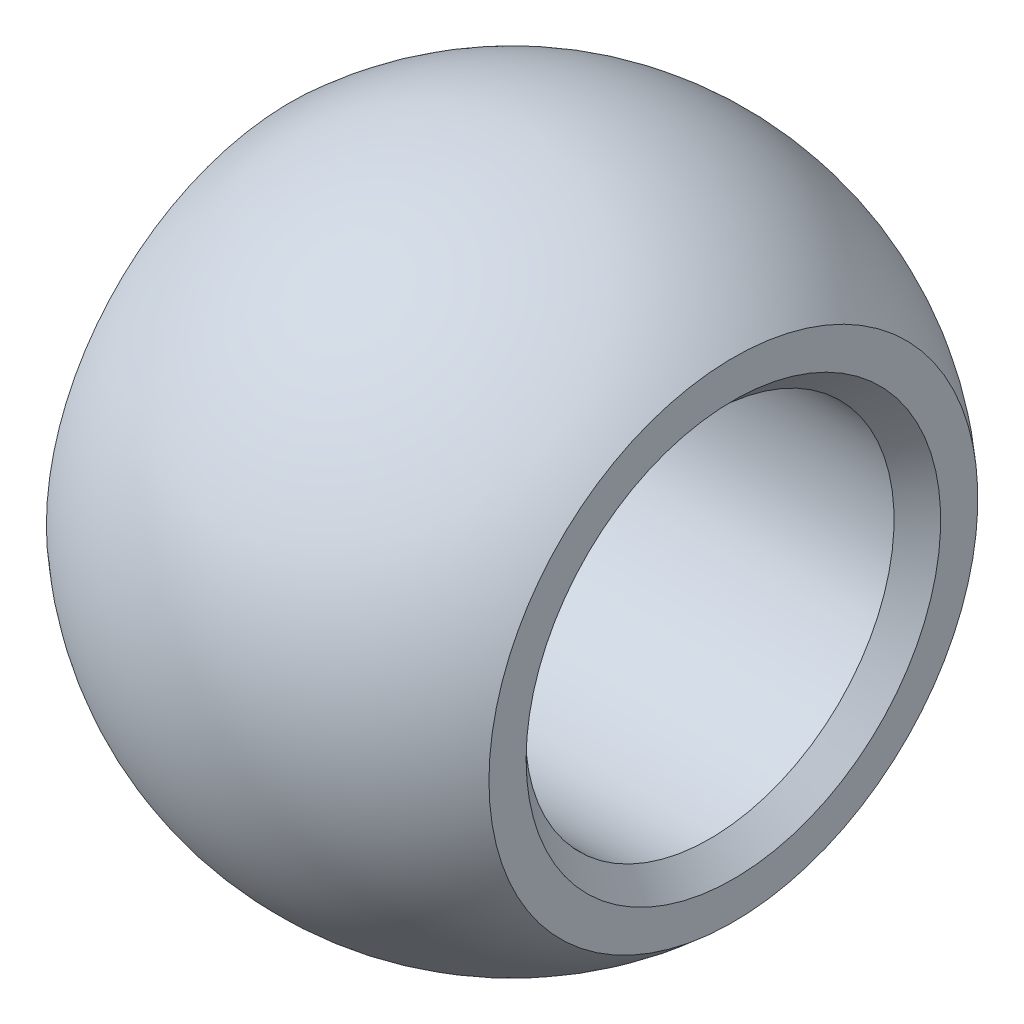
ISO-10303-21;
HEADER;
FILE_DESCRIPTION(('STEP AP214'),'2;1');
FILE_NAME('part.step','',(''),(''),'','','');
FILE_SCHEMA(('AUTOMOTIVE_DESIGN { 1 0 10303 214 1 1 1 1 }'));
ENDSEC;
DATA;
#1=APPLICATION_CONTEXT('core data for automotive mechanical design processes');
#2=APPLICATION_PROTOCOL_DEFINITION('international standard','automotive_design',2000,#1);
#3=PRODUCT_CONTEXT('',#1,'mechanical');
#4=PRODUCT('Part','Part','',(#3));
#5=PRODUCT_RELATED_PRODUCT_CATEGORY('part','',(#4));
#6=PRODUCT_DEFINITION_FORMATION('','',#4);
#7=PRODUCT_DEFINITION_CONTEXT('part definition',#1,'design');
#8=PRODUCT_DEFINITION('design','',#6,#7);
#9=PRODUCT_DEFINITION_SHAPE('','',#8);
#10=(LENGTH_UNIT() NAMED_UNIT(*) SI_UNIT(.MILLI.,.METRE.));
#11=(NAMED_UNIT(*) PLANE_ANGLE_UNIT() SI_UNIT($,.RADIAN.));
#12=(NAMED_UNIT(*) SI_UNIT($,.STERADIAN.) SOLID_ANGLE_UNIT());
#13=UNCERTAINTY_MEASURE_WITH_UNIT(LENGTH_MEASURE(1.E-05),#10,'distance_accuracy_value','');
#14=(GEOMETRIC_REPRESENTATION_CONTEXT(3) GLOBAL_UNCERTAINTY_ASSIGNED_CONTEXT((#13)) GLOBAL_UNIT_ASSIGNED_CONTEXT((#10,
#11,#12)) REPRESENTATION_CONTEXT('',''));
#15=CARTESIAN_POINT('',(0.,0.,0.));
#16=DIRECTION('',(0.,0.,1.));
#17=DIRECTION('',(1.,0.,0.));
#18=AXIS2_PLACEMENT_3D('',#15,#16,#17);
#19=CARTESIAN_POINT('',(0.,0.,0.));
#20=DIRECTION('',(-1.,0.,0.));
#21=DIRECTION('',(0.,1.,0.));
#22=AXIS2_PLACEMENT_3D('',#19,#20,#21);
#23=SPHERICAL_SURFACE('',#22,7.1);
#24=CARTESIAN_POINT('',(-4.765,0.,0.));
#25=DIRECTION('',(-1.,0.,0.));
#26=DIRECTION('',(0.,0.,1.));
#27=AXIS2_PLACEMENT_3D('',#24,#25,#26);
#28=CIRCLE('',#27,5.26353255903296);
#29=CARTESIAN_POINT('',(-4.765,0.,5.26353255903296));
#30=VERTEX_POINT('',#29);
#31=EDGE_CURVE('E53',#30,#30,#28,.T.);
#32=ORIENTED_EDGE('',*,*,#31,.F.);
#33=EDGE_LOOP('',(#32));
#34=FACE_BOUND('',#33,.T.);
#35=CARTESIAN_POINT('',(4.765,0.,0.));
#36=DIRECTION('',(-1.,0.,0.));
#37=DIRECTION('',(0.,0.,1.));
#38=AXIS2_PLACEMENT_3D('',#35,#36,#37);
#39=CIRCLE('',#38,5.26353255903296);
#40=CARTESIAN_POINT('',(4.765,0.,5.26353255903296));
#41=VERTEX_POINT('',#40);
#42=EDGE_CURVE('E10',#41,#41,#39,.T.);
#43=ORIENTED_EDGE('',*,*,#42,.T.);
#44=EDGE_LOOP('',(#43));
#45=FACE_BOUND('',#44,.T.);
#46=ADVANCED_FACE('F31',(#34,#45),#23,.T.);
#47=CARTESIAN_POINT('',(4.765,4.46353255903296,0.));
#48=DIRECTION('',(-1.,0.,0.));
#49=DIRECTION('',(0.,0.,1.));
#50=AXIS2_PLACEMENT_3D('',#47,#48,#49);
#51=PLANE('',#50);
#52=ORIENTED_EDGE('',*,*,#42,.F.);
#53=EDGE_LOOP('',(#52));
#54=FACE_BOUND('',#53,.T.);
#55=CARTESIAN_POINT('',(4.765,0.,0.));
#56=DIRECTION('',(-1.,0.,0.));
#57=DIRECTION('',(0.,0.,1.));
#58=AXIS2_PLACEMENT_3D('',#55,#56,#57);
#59=CIRCLE('',#58,4.46353255903296);
#60=CARTESIAN_POINT('',(4.765,0.,4.46353255903296));
#61=VERTEX_POINT('',#60);
#62=EDGE_CURVE('E37',#61,#61,#59,.T.);
#63=ORIENTED_EDGE('',*,*,#62,.T.);
#64=EDGE_LOOP('',(#63));
#65=FACE_BOUND('',#64,.T.);
#66=ADVANCED_FACE('F60',(#54,#65),#51,.F.);
#67=CARTESIAN_POINT('',(4.255,0.,0.));
#68=DIRECTION('',(1.,0.,0.));
#69=DIRECTION('',(0.,0.,-1.));
#70=AXIS2_PLACEMENT_3D('',#67,#68,#69);
#71=CONICAL_SURFACE('',#70,3.97,0.768990162490585);
#72=ORIENTED_EDGE('',*,*,#62,.F.);
#73=EDGE_LOOP('',(#72));
#74=FACE_BOUND('',#73,.T.);
#75=CARTESIAN_POINT('',(4.255,0.,0.));
#76=DIRECTION('',(-1.,0.,0.));
#77=DIRECTION('',(0.,0.,1.));
#78=AXIS2_PLACEMENT_3D('',#75,#76,#77);
#79=CIRCLE('',#78,3.97);
#80=CARTESIAN_POINT('',(4.255,0.,3.97));
#81=VERTEX_POINT('',#80);
#82=EDGE_CURVE('E41',#81,#81,#79,.T.);
#83=ORIENTED_EDGE('',*,*,#82,.T.);
#84=EDGE_LOOP('',(#83));
#85=FACE_BOUND('',#84,.T.);
#86=ADVANCED_FACE('F64',(#74,#85),#71,.F.);
#87=CARTESIAN_POINT('',(-4.765,0.,0.));
#88=DIRECTION('',(-1.,0.,0.));
#89=DIRECTION('',(0.,0.,1.));
#90=AXIS2_PLACEMENT_3D('',#87,#88,#89);
#91=CYLINDRICAL_SURFACE('',#90,3.97);
#92=ORIENTED_EDGE('',*,*,#82,.F.);
#93=EDGE_LOOP('',(#92));
#94=FACE_BOUND('',#93,.T.);
#95=CARTESIAN_POINT('',(-4.255,0.,0.));
#96=DIRECTION('',(-1.,0.,0.));
#97=DIRECTION('',(0.,0.,1.));
#98=AXIS2_PLACEMENT_3D('',#95,#96,#97);
#99=CIRCLE('',#98,3.97);
#100=CARTESIAN_POINT('',(-4.255,0.,3.97));
#101=VERTEX_POINT('',#100);
#102=EDGE_CURVE('E45',#101,#101,#99,.T.);
#103=ORIENTED_EDGE('',*,*,#102,.T.);
#104=EDGE_LOOP('',(#103));
#105=FACE_BOUND('',#104,.T.);
#106=ADVANCED_FACE('F69',(#94,#105),#91,.F.);
#107=CARTESIAN_POINT('',(-4.765,0.,0.));
#108=DIRECTION('',(-1.,0.,0.));
#109=DIRECTION('',(0.,0.,1.));
#110=AXIS2_PLACEMENT_3D('',#107,#108,#109);
#111=CONICAL_SURFACE('',#110,4.46353255903296,0.768990162490585);
#112=ORIENTED_EDGE('',*,*,#102,.F.);
#113=EDGE_LOOP('',(#112));
#114=FACE_BOUND('',#113,.T.);
#115=CARTESIAN_POINT('',(-4.765,0.,0.));
#116=DIRECTION('',(-1.,0.,0.));
#117=DIRECTION('',(0.,0.,1.));
#118=AXIS2_PLACEMENT_3D('',#115,#116,#117);
#119=CIRCLE('',#118,4.46353255903296);
#120=CARTESIAN_POINT('',(-4.765,0.,4.46353255903296));
#121=VERTEX_POINT('',#120);
#122=EDGE_CURVE('E50',#121,#121,#119,.T.);
#123=ORIENTED_EDGE('',*,*,#122,.T.);
#124=EDGE_LOOP('',(#123));
#125=FACE_BOUND('',#124,.T.);
#126=ADVANCED_FACE('F75',(#114,#125),#111,.F.);
#127=CARTESIAN_POINT('',(-4.765,4.46353255903296,0.));
#128=DIRECTION('',(1.,0.,0.));
#129=DIRECTION('',(0.,0.,-1.));
#130=AXIS2_PLACEMENT_3D('',#127,#128,#129);
#131=PLANE('',#130);
#132=ORIENTED_EDGE('',*,*,#122,.F.);
#133=EDGE_LOOP('',(#132));
#134=FACE_BOUND('',#133,.T.);
#135=ORIENTED_EDGE('',*,*,#31,.T.);
#136=EDGE_LOOP('',(#135));
#137=FACE_BOUND('',#136,.T.);
#138=ADVANCED_FACE('F57',(#134,#137),#131,.F.);
#139=CLOSED_SHELL('',(#46,#66,#86,#106,#126,#138));
#140=MANIFOLD_SOLID_BREP('B2',#139);
#141=ADVANCED_BREP_SHAPE_REPRESENTATION('',(#18,#140),#14);
#142=SHAPE_DEFINITION_REPRESENTATION(#9,#141);
ENDSEC;
END-ISO-10303-21;
